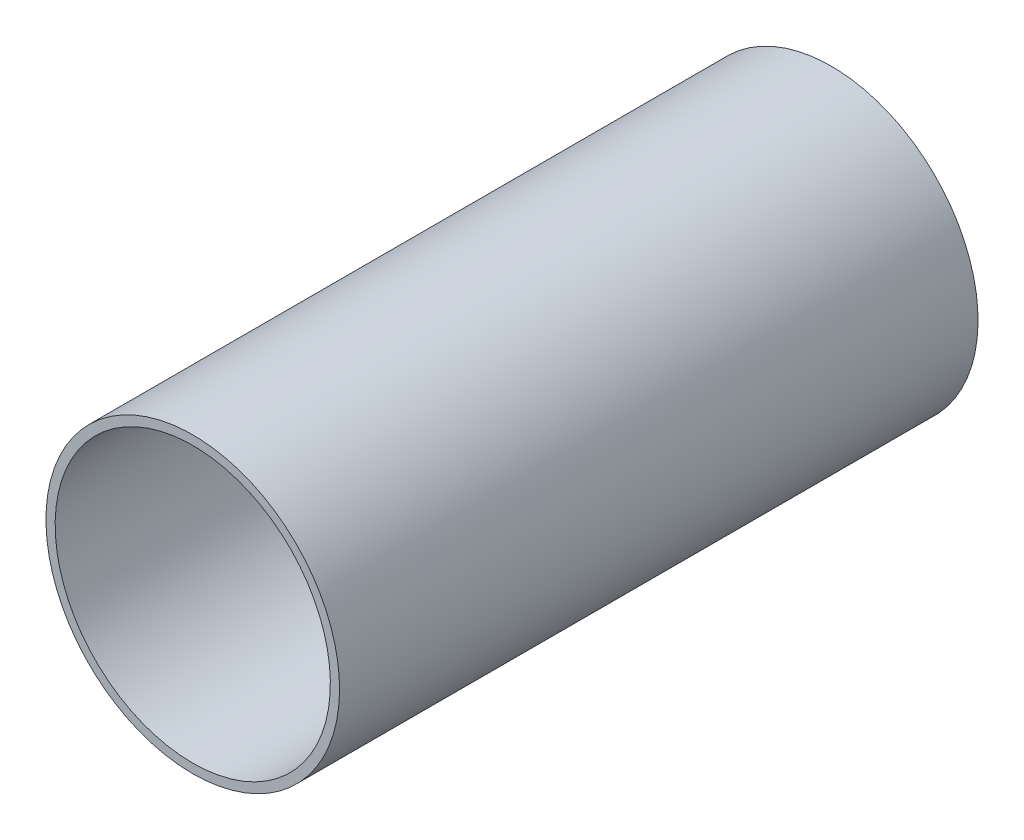
ISO-10303-21;
HEADER;
FILE_DESCRIPTION(('STEP AP214'),'2;1');
FILE_NAME('part.step','',(''),(''),'','','');
FILE_SCHEMA(('AUTOMOTIVE_DESIGN { 1 0 10303 214 1 1 1 1 }'));
ENDSEC;
DATA;
#1=APPLICATION_CONTEXT('core data for automotive mechanical design processes');
#2=APPLICATION_PROTOCOL_DEFINITION('international standard','automotive_design',2000,#1);
#3=PRODUCT_CONTEXT('',#1,'mechanical');
#4=PRODUCT('Part','Part','',(#3));
#5=PRODUCT_RELATED_PRODUCT_CATEGORY('part','',(#4));
#6=PRODUCT_DEFINITION_FORMATION('','',#4);
#7=PRODUCT_DEFINITION_CONTEXT('part definition',#1,'design');
#8=PRODUCT_DEFINITION('design','',#6,#7);
#9=PRODUCT_DEFINITION_SHAPE('','',#8);
#10=(LENGTH_UNIT() NAMED_UNIT(*) SI_UNIT(.MILLI.,.METRE.));
#11=(NAMED_UNIT(*) PLANE_ANGLE_UNIT() SI_UNIT($,.RADIAN.));
#12=(NAMED_UNIT(*) SI_UNIT($,.STERADIAN.) SOLID_ANGLE_UNIT());
#13=UNCERTAINTY_MEASURE_WITH_UNIT(LENGTH_MEASURE(1.E-05),#10,'distance_accuracy_value','');
#14=(GEOMETRIC_REPRESENTATION_CONTEXT(3) GLOBAL_UNCERTAINTY_ASSIGNED_CONTEXT((#13)) GLOBAL_UNIT_ASSIGNED_CONTEXT((#10,
#11,#12)) REPRESENTATION_CONTEXT('',''));
#15=CARTESIAN_POINT('',(0.,0.,0.));
#16=DIRECTION('',(0.,0.,1.));
#17=DIRECTION('',(1.,0.,0.));
#18=AXIS2_PLACEMENT_3D('',#15,#16,#17);
#19=CARTESIAN_POINT('',(134.62,-103.632,-0.045));
#20=DIRECTION('',(0.,0.,-1.));
#21=DIRECTION('',(0.,-1.,0.));
#22=AXIS2_PLACEMENT_3D('',#19,#20,#21);
#23=CYLINDRICAL_SURFACE('',#22,0.375);
#24=CARTESIAN_POINT('',(134.62,-103.632,-0.035));
#25=DIRECTION('',(0.,0.,-1.));
#26=DIRECTION('',(0.,-1.,0.));
#27=AXIS2_PLACEMENT_3D('',#24,#25,#26);
#28=CIRCLE('',#27,0.375);
#29=CARTESIAN_POINT('',(134.62,-104.007,-0.035));
#30=VERTEX_POINT('',#29);
#31=EDGE_CURVE('E64',#30,#30,#28,.T.);
#32=ORIENTED_EDGE('',*,*,#31,.T.);
#33=DIRECTION('',(0.,0.,1.));
#34=VECTOR('',#33,1.);
#35=CARTESIAN_POINT('',(134.62,-104.007,-0.045));
#36=LINE('',#35,#34);
#37=CARTESIAN_POINT('',(134.62,-104.007,1.705));
#38=VERTEX_POINT('',#37);
#39=EDGE_CURVE('E11',#30,#38,#36,.T.);
#40=ORIENTED_EDGE('',*,*,#39,.T.);
#41=CARTESIAN_POINT('',(134.62,-103.632,1.705));
#42=DIRECTION('',(0.,0.,-1.));
#43=DIRECTION('',(0.,-1.,0.));
#44=AXIS2_PLACEMENT_3D('',#41,#42,#43);
#45=CIRCLE('',#44,0.375);
#46=EDGE_CURVE('E25',#38,#38,#45,.T.);
#47=ORIENTED_EDGE('',*,*,#46,.F.);
#48=ORIENTED_EDGE('',*,*,#39,.F.);
#49=EDGE_LOOP('',(#32,#40,#47,#48));
#50=FACE_BOUND('',#49,.T.);
#51=ADVANCED_FACE('F17',(#50),#23,.F.);
#52=CARTESIAN_POINT('',(134.62,-104.032,1.705));
#53=DIRECTION('',(0.,0.,1.));
#54=DIRECTION('',(1.,0.,0.));
#55=AXIS2_PLACEMENT_3D('',#52,#53,#54);
#56=PLANE('',#55);
#57=ORIENTED_EDGE('',*,*,#46,.T.);
#58=EDGE_LOOP('',(#57));
#59=FACE_BOUND('',#58,.T.);
#60=CARTESIAN_POINT('',(134.62,-103.632,1.705));
#61=DIRECTION('',(0.,0.,1.));
#62=DIRECTION('',(0.,-1.,0.));
#63=AXIS2_PLACEMENT_3D('',#60,#61,#62);
#64=CIRCLE('',#63,0.4);
#65=CARTESIAN_POINT('',(134.62,-104.032,1.705));
#66=VERTEX_POINT('',#65);
#67=EDGE_CURVE('E56',#66,#66,#64,.T.);
#68=ORIENTED_EDGE('',*,*,#67,.T.);
#69=EDGE_LOOP('',(#68));
#70=FACE_BOUND('',#69,.T.);
#71=ADVANCED_FACE('F73',(#59,#70),#56,.T.);
#72=CARTESIAN_POINT('',(134.62,-104.032,-0.035));
#73=DIRECTION('',(0.,0.,1.));
#74=DIRECTION('',(1.,0.,0.));
#75=AXIS2_PLACEMENT_3D('',#72,#73,#74);
#76=PLANE('',#75);
#77=ORIENTED_EDGE('',*,*,#31,.F.);
#78=EDGE_LOOP('',(#77));
#79=FACE_BOUND('',#78,.T.);
#80=CARTESIAN_POINT('',(134.62,-103.632,-0.035));
#81=DIRECTION('',(0.,0.,1.));
#82=DIRECTION('',(0.,-1.,0.));
#83=AXIS2_PLACEMENT_3D('',#80,#81,#82);
#84=CIRCLE('',#83,0.4);
#85=CARTESIAN_POINT('',(134.62,-104.032,-0.035));
#86=VERTEX_POINT('',#85);
#87=EDGE_CURVE('E55',#86,#86,#84,.T.);
#88=ORIENTED_EDGE('',*,*,#87,.F.);
#89=EDGE_LOOP('',(#88));
#90=FACE_BOUND('',#89,.T.);
#91=ADVANCED_FACE('F82',(#79,#90),#76,.F.);
#92=CARTESIAN_POINT('',(134.62,-103.632,-0.035));
#93=DIRECTION('',(0.,0.,-1.));
#94=DIRECTION('',(0.,-1.,0.));
#95=AXIS2_PLACEMENT_3D('',#92,#93,#94);
#96=CYLINDRICAL_SURFACE('',#95,0.4);
#97=ORIENTED_EDGE('',*,*,#87,.T.);
#98=DIRECTION('',(0.,0.,1.));
#99=VECTOR('',#98,1.);
#100=CARTESIAN_POINT('',(134.62,-104.032,-0.035));
#101=LINE('',#100,#99);
#102=EDGE_CURVE('E52',#86,#66,#101,.T.);
#103=ORIENTED_EDGE('',*,*,#102,.T.);
#104=ORIENTED_EDGE('',*,*,#67,.F.);
#105=ORIENTED_EDGE('',*,*,#102,.F.);
#106=EDGE_LOOP('',(#97,#103,#104,#105));
#107=FACE_BOUND('',#106,.T.);
#108=ADVANCED_FACE('F53',(#107),#96,.T.);
#109=CLOSED_SHELL('',(#51,#71,#91,#108));
#110=MANIFOLD_SOLID_BREP('B1',#109);
#111=ADVANCED_BREP_SHAPE_REPRESENTATION('',(#18,#110),#14);
#112=SHAPE_DEFINITION_REPRESENTATION(#9,#111);
ENDSEC;
END-ISO-10303-21;
